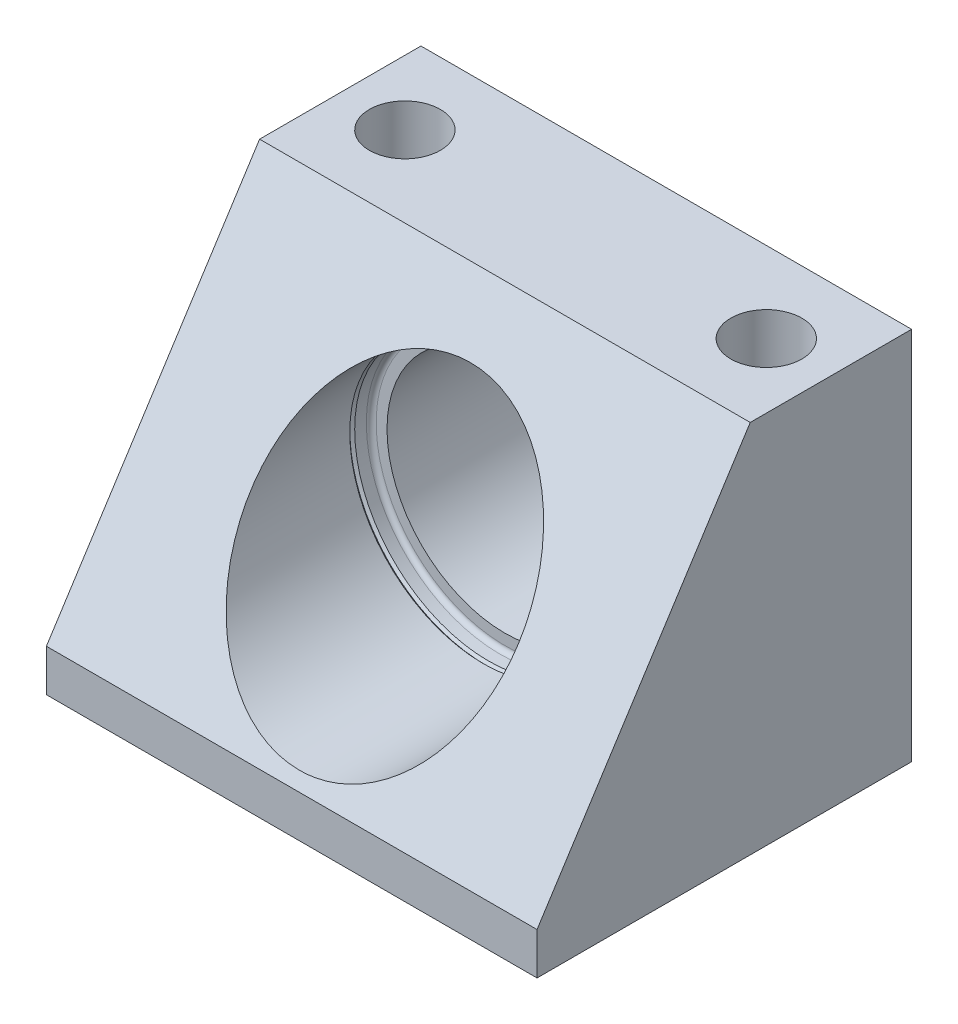
ISO-10303-21;
HEADER;
FILE_DESCRIPTION(('STEP AP214'),'2;1');
FILE_NAME('part.step','',(''),(''),'','','');
FILE_SCHEMA(('AUTOMOTIVE_DESIGN { 1 0 10303 214 1 1 1 1 }'));
ENDSEC;
DATA;
#1=APPLICATION_CONTEXT('core data for automotive mechanical design processes');
#2=APPLICATION_PROTOCOL_DEFINITION('international standard','automotive_design',2000,#1);
#3=PRODUCT_CONTEXT('',#1,'mechanical');
#4=PRODUCT('Part','Part','',(#3));
#5=PRODUCT_RELATED_PRODUCT_CATEGORY('part','',(#4));
#6=PRODUCT_DEFINITION_FORMATION('','',#4);
#7=PRODUCT_DEFINITION_CONTEXT('part definition',#1,'design');
#8=PRODUCT_DEFINITION('design','',#6,#7);
#9=PRODUCT_DEFINITION_SHAPE('','',#8);
#10=(LENGTH_UNIT() NAMED_UNIT(*) SI_UNIT(.MILLI.,.METRE.));
#11=(NAMED_UNIT(*) PLANE_ANGLE_UNIT() SI_UNIT($,.RADIAN.));
#12=(NAMED_UNIT(*) SI_UNIT($,.STERADIAN.) SOLID_ANGLE_UNIT());
#13=UNCERTAINTY_MEASURE_WITH_UNIT(LENGTH_MEASURE(1.E-05),#10,'distance_accuracy_value','');
#14=(GEOMETRIC_REPRESENTATION_CONTEXT(3) GLOBAL_UNCERTAINTY_ASSIGNED_CONTEXT((#13)) GLOBAL_UNIT_ASSIGNED_CONTEXT((#10,
#11,#12)) REPRESENTATION_CONTEXT('',''));
#15=CARTESIAN_POINT('',(0.,0.,0.));
#16=DIRECTION('',(0.,0.,1.));
#17=DIRECTION('',(1.,0.,0.));
#18=AXIS2_PLACEMENT_3D('',#15,#16,#17);
#19=CARTESIAN_POINT('',(37.9984,29.0068,-58.0136));
#20=DIRECTION('',(0.,0.,1.));
#21=DIRECTION('',(1.,0.,0.));
#22=AXIS2_PLACEMENT_3D('',#19,#20,#21);
#23=CYLINDRICAL_SURFACE('',#22,18.2625);
#24=CARTESIAN_POINT('',(37.9984,29.0068,-33.02));
#25=DIRECTION('',(0.,0.,1.));
#26=DIRECTION('',(1.,0.,0.));
#27=AXIS2_PLACEMENT_3D('',#24,#25,#26);
#28=CIRCLE('',#27,18.2625);
#29=CARTESIAN_POINT('',(56.2609,29.0068,-33.02));
#30=VERTEX_POINT('',#29);
#31=EDGE_CURVE('E119',#30,#30,#28,.F.);
#32=ORIENTED_EDGE('',*,*,#31,.F.);
#33=EDGE_LOOP('',(#32));
#34=FACE_BOUND('',#33,.T.);
#35=CARTESIAN_POINT('',(37.9984,29.0068,-56.8451));
#36=DIRECTION('',(0.,0.,1.));
#37=DIRECTION('',(1.,0.,0.));
#38=AXIS2_PLACEMENT_3D('',#35,#36,#37);
#39=CIRCLE('',#38,18.2625);
#40=CARTESIAN_POINT('',(56.2609,29.0068,-56.8451));
#41=VERTEX_POINT('',#40);
#42=EDGE_CURVE('E204',#41,#41,#39,.T.);
#43=ORIENTED_EDGE('',*,*,#42,.F.);
#44=EDGE_LOOP('',(#43));
#45=FACE_BOUND('',#44,.T.);
#46=ADVANCED_FACE('F35',(#34,#45),#23,.F.);
#47=CARTESIAN_POINT('',(0.,58.0136,-58.0136));
#48=DIRECTION('',(0.,0.,1.));
#49=DIRECTION('',(1.,0.,0.));
#50=AXIS2_PLACEMENT_3D('',#47,#48,#49);
#51=PLANE('',#50);
#52=DIRECTION('',(0.,-1.,0.));
#53=VECTOR('',#52,1.);
#54=CARTESIAN_POINT('',(0.,58.0136,-58.0136));
#55=LINE('',#54,#53);
#56=CARTESIAN_POINT('',(0.,58.0136,-58.0136));
#57=VERTEX_POINT('',#56);
#58=CARTESIAN_POINT('',(0.,0.,-58.0136));
#59=VERTEX_POINT('',#58);
#60=EDGE_CURVE('E128',#57,#59,#55,.T.);
#61=ORIENTED_EDGE('',*,*,#60,.F.);
#62=DIRECTION('',(-1.,0.,0.));
#63=VECTOR('',#62,1.);
#64=CARTESIAN_POINT('',(0.,58.0136,-58.0136));
#65=LINE('',#64,#63);
#66=CARTESIAN_POINT('',(75.9968,58.0136,-58.0136));
#67=VERTEX_POINT('',#66);
#68=EDGE_CURVE('E105',#67,#57,#65,.T.);
#69=ORIENTED_EDGE('',*,*,#68,.F.);
#70=DIRECTION('',(0.,1.,0.));
#71=VECTOR('',#70,1.);
#72=CARTESIAN_POINT('',(75.9968,58.0136,-58.0136));
#73=LINE('',#72,#71);
#74=CARTESIAN_POINT('',(75.9968,0.,-58.0136));
#75=VERTEX_POINT('',#74);
#76=EDGE_CURVE('E132',#75,#67,#73,.T.);
#77=ORIENTED_EDGE('',*,*,#76,.F.);
#78=DIRECTION('',(1.,0.,0.));
#79=VECTOR('',#78,1.);
#80=CARTESIAN_POINT('',(0.,0.,-58.0136));
#81=LINE('',#80,#79);
#82=EDGE_CURVE('E130',#59,#75,#81,.T.);
#83=ORIENTED_EDGE('',*,*,#82,.F.);
#84=EDGE_LOOP('',(#61,#69,#77,#83));
#85=FACE_BOUND('',#84,.T.);
#86=CARTESIAN_POINT('',(37.9984,29.0068,-58.0136));
#87=DIRECTION('',(0.,0.,1.));
#88=DIRECTION('',(1.,0.,0.));
#89=AXIS2_PLACEMENT_3D('',#86,#87,#88);
#90=CIRCLE('',#89,19.431);
#91=CARTESIAN_POINT('',(57.4294,29.0068,-58.0136));
#92=VERTEX_POINT('',#91);
#93=EDGE_CURVE('E201',#92,#92,#90,.T.);
#94=ORIENTED_EDGE('',*,*,#93,.T.);
#95=EDGE_LOOP('',(#94));
#96=FACE_BOUND('',#95,.T.);
#97=ADVANCED_FACE('F145',(#85,#96),#51,.F.);
#98=CARTESIAN_POINT('',(37.9984,29.0068,-116.564869909371));
#99=DIRECTION('',(0.,0.,1.));
#100=DIRECTION('',(1.,0.,0.));
#101=AXIS2_PLACEMENT_3D('',#98,#99,#100);
#102=CYLINDRICAL_SURFACE('',#101,20.701);
#103=CARTESIAN_POINT('',(37.9984,29.0068,-14.4258974358974));
#104=DIRECTION('',(0.,-0.539666114720432,-0.841879138963874));
#105=DIRECTION('',(0.,-0.841879138963874,0.539666114720432));
#106=AXIS2_PLACEMENT_3D('',#103,#104,#105);
#107=ELLIPSE('',#106,24.5890402100679,20.701);
#108=CARTESIAN_POINT('',(37.9984,8.30579999999999,-1.15602564102561));
#109=VERTEX_POINT('',#108);
#110=EDGE_CURVE('E116',#109,#109,#107,.F.);
#111=ORIENTED_EDGE('',*,*,#110,.T.);
#112=EDGE_LOOP('',(#111));
#113=FACE_BOUND('',#112,.T.);
#114=CARTESIAN_POINT('',(37.9984,29.0068,-29.6926));
#115=DIRECTION('',(0.,0.,1.));
#116=DIRECTION('',(1.,0.,0.));
#117=AXIS2_PLACEMENT_3D('',#114,#115,#116);
#118=CIRCLE('',#117,20.701);
#119=CARTESIAN_POINT('',(58.6994,29.0068,-29.6926));
#120=VERTEX_POINT('',#119);
#121=EDGE_CURVE('E198',#120,#120,#118,.T.);
#122=ORIENTED_EDGE('',*,*,#121,.F.);
#123=EDGE_LOOP('',(#122));
#124=FACE_BOUND('',#123,.T.);
#125=ADVANCED_FACE('F166',(#113,#124),#102,.F.);
#126=CARTESIAN_POINT('',(37.9984,29.0068,-32.258));
#127=DIRECTION('',(0.,0.,1.));
#128=DIRECTION('',(1.,0.,0.));
#129=AXIS2_PLACEMENT_3D('',#126,#127,#128);
#130=CIRCLE('',#129,20.701);
#131=CARTESIAN_POINT('',(58.6994,29.0068,-32.258));
#132=VERTEX_POINT('',#131);
#133=EDGE_CURVE('E12',#132,#132,#130,.F.);
#134=ORIENTED_EDGE('',*,*,#133,.T.);
#135=EDGE_LOOP('',(#134));
#136=FACE_BOUND('',#135,.T.);
#137=CARTESIAN_POINT('',(37.9984,29.0068,-30.4546));
#138=DIRECTION('',(0.,0.,1.));
#139=DIRECTION('',(1.,0.,0.));
#140=AXIS2_PLACEMENT_3D('',#137,#138,#139);
#141=CIRCLE('',#140,20.701);
#142=CARTESIAN_POINT('',(58.6994,29.0068,-30.4546));
#143=VERTEX_POINT('',#142);
#144=EDGE_CURVE('E195',#143,#143,#141,.T.);
#145=ORIENTED_EDGE('',*,*,#144,.T.);
#146=EDGE_LOOP('',(#145));
#147=FACE_BOUND('',#146,.T.);
#148=ADVANCED_FACE('F234',(#136,#147),#102,.F.);
#149=CARTESIAN_POINT('',(0.,58.0136,-33.02));
#150=DIRECTION('',(0.,-0.539666114720432,-0.841879138963874));
#151=DIRECTION('',(0.,0.841879138963874,-0.539666114720432));
#152=AXIS2_PLACEMENT_3D('',#149,#150,#151);
#153=PLANE('',#152);
#154=DIRECTION('',(0.,0.841879138963874,-0.539666114720432));
#155=VECTOR('',#154,1.);
#156=CARTESIAN_POINT('',(75.9968,58.0136,-33.02));
#157=LINE('',#156,#155);
#158=CARTESIAN_POINT('',(75.9968,6.50240000000002,0.));
#159=VERTEX_POINT('',#158);
#160=CARTESIAN_POINT('',(75.9968,58.0136,-33.02));
#161=VERTEX_POINT('',#160);
#162=EDGE_CURVE('E93',#159,#161,#157,.T.);
#163=ORIENTED_EDGE('',*,*,#162,.T.);
#164=DIRECTION('',(1.,0.,0.));
#165=VECTOR('',#164,1.);
#166=CARTESIAN_POINT('',(0.,58.0136,-33.02));
#167=LINE('',#166,#165);
#168=CARTESIAN_POINT('',(0.,58.0136,-33.02));
#169=VERTEX_POINT('',#168);
#170=EDGE_CURVE('E89',#169,#161,#167,.T.);
#171=ORIENTED_EDGE('',*,*,#170,.F.);
#172=DIRECTION('',(0.,0.841879138963874,-0.539666114720432));
#173=VECTOR('',#172,1.);
#174=CARTESIAN_POINT('',(0.,58.0136,-33.02));
#175=LINE('',#174,#173);
#176=CARTESIAN_POINT('',(0.,6.50240000000003,0.));
#177=VERTEX_POINT('',#176);
#178=EDGE_CURVE('E50',#177,#169,#175,.T.);
#179=ORIENTED_EDGE('',*,*,#178,.F.);
#180=DIRECTION('',(1.,0.,0.));
#181=VECTOR('',#180,1.);
#182=CARTESIAN_POINT('',(0.,6.50240000000003,0.));
#183=LINE('',#182,#181);
#184=EDGE_CURVE('E97',#177,#159,#183,.T.);
#185=ORIENTED_EDGE('',*,*,#184,.T.);
#186=EDGE_LOOP('',(#163,#171,#179,#185));
#187=FACE_BOUND('',#186,.T.);
#188=ORIENTED_EDGE('',*,*,#110,.F.);
#189=EDGE_LOOP('',(#188));
#190=FACE_BOUND('',#189,.T.);
#191=ADVANCED_FACE('F90',(#187,#190),#153,.F.);
#192=CARTESIAN_POINT('',(0.,58.0136,-58.0136));
#193=DIRECTION('',(-1.,0.,0.));
#194=DIRECTION('',(0.,-1.,0.));
#195=AXIS2_PLACEMENT_3D('',#192,#193,#194);
#196=PLANE('',#195);
#197=ORIENTED_EDGE('',*,*,#178,.T.);
#198=DIRECTION('',(0.,0.,1.));
#199=VECTOR('',#198,1.);
#200=CARTESIAN_POINT('',(0.,58.0136,-58.0136));
#201=LINE('',#200,#199);
#202=EDGE_CURVE('E58',#57,#169,#201,.T.);
#203=ORIENTED_EDGE('',*,*,#202,.F.);
#204=ORIENTED_EDGE('',*,*,#60,.T.);
#205=DIRECTION('',(0.,0.,1.));
#206=VECTOR('',#205,1.);
#207=CARTESIAN_POINT('',(0.,0.,-58.0136));
#208=LINE('',#207,#206);
#209=CARTESIAN_POINT('',(0.,0.,0.));
#210=VERTEX_POINT('',#209);
#211=EDGE_CURVE('E80',#59,#210,#208,.T.);
#212=ORIENTED_EDGE('',*,*,#211,.T.);
#213=DIRECTION('',(0.,-1.,0.));
#214=VECTOR('',#213,1.);
#215=CARTESIAN_POINT('',(0.,58.0136,0.));
#216=LINE('',#215,#214);
#217=EDGE_CURVE('E96',#177,#210,#216,.T.);
#218=ORIENTED_EDGE('',*,*,#217,.F.);
#219=EDGE_LOOP('',(#197,#203,#204,#212,#218));
#220=FACE_BOUND('',#219,.T.);
#221=ADVANCED_FACE('F100',(#220),#196,.T.);
#222=CARTESIAN_POINT('',(0.,58.0136,-58.0136));
#223=DIRECTION('',(0.,1.,0.));
#224=DIRECTION('',(0.,0.,1.));
#225=AXIS2_PLACEMENT_3D('',#222,#223,#224);
#226=PLANE('',#225);
#227=CARTESIAN_POINT('',(10.0076,58.0136,-45.5168));
#228=DIRECTION('',(0.,1.,0.));
#229=DIRECTION('',(0.,0.,1.));
#230=AXIS2_PLACEMENT_3D('',#227,#228,#229);
#231=CIRCLE('',#230,5.49910000000001);
#232=CARTESIAN_POINT('',(10.0076,58.0136,-40.0177));
#233=VERTEX_POINT('',#232);
#234=EDGE_CURVE('E180',#233,#233,#231,.T.);
#235=ORIENTED_EDGE('',*,*,#234,.F.);
#236=EDGE_LOOP('',(#235));
#237=FACE_BOUND('',#236,.T.);
#238=CARTESIAN_POINT('',(65.9892,58.0136,-45.5168));
#239=DIRECTION('',(0.,1.,0.));
#240=DIRECTION('',(0.,0.,1.));
#241=AXIS2_PLACEMENT_3D('',#238,#239,#240);
#242=CIRCLE('',#241,5.49910000000001);
#243=CARTESIAN_POINT('',(65.9892,58.0136,-40.0177));
#244=VERTEX_POINT('',#243);
#245=EDGE_CURVE('E183',#244,#244,#242,.T.);
#246=ORIENTED_EDGE('',*,*,#245,.F.);
#247=EDGE_LOOP('',(#246));
#248=FACE_BOUND('',#247,.T.);
#249=ORIENTED_EDGE('',*,*,#170,.T.);
#250=DIRECTION('',(0.,0.,1.));
#251=VECTOR('',#250,1.);
#252=CARTESIAN_POINT('',(75.9968,58.0136,-58.0136));
#253=LINE('',#252,#251);
#254=EDGE_CURVE('E106',#67,#161,#253,.T.);
#255=ORIENTED_EDGE('',*,*,#254,.F.);
#256=ORIENTED_EDGE('',*,*,#68,.T.);
#257=ORIENTED_EDGE('',*,*,#202,.T.);
#258=EDGE_LOOP('',(#249,#255,#256,#257));
#259=FACE_BOUND('',#258,.T.);
#260=ADVANCED_FACE('F103',(#237,#248,#259),#226,.T.);
#261=CARTESIAN_POINT('',(75.9968,58.0136,-58.0136));
#262=DIRECTION('',(1.,0.,0.));
#263=DIRECTION('',(0.,1.,0.));
#264=AXIS2_PLACEMENT_3D('',#261,#262,#263);
#265=PLANE('',#264);
#266=ORIENTED_EDGE('',*,*,#162,.F.);
#267=DIRECTION('',(0.,1.,0.));
#268=VECTOR('',#267,1.);
#269=CARTESIAN_POINT('',(75.9968,58.0136,0.));
#270=LINE('',#269,#268);
#271=CARTESIAN_POINT('',(75.9968,0.,0.));
#272=VERTEX_POINT('',#271);
#273=EDGE_CURVE('E111',#272,#159,#270,.T.);
#274=ORIENTED_EDGE('',*,*,#273,.F.);
#275=DIRECTION('',(0.,0.,1.));
#276=VECTOR('',#275,1.);
#277=CARTESIAN_POINT('',(75.9968,0.,-58.0136));
#278=LINE('',#277,#276);
#279=EDGE_CURVE('E75',#75,#272,#278,.T.);
#280=ORIENTED_EDGE('',*,*,#279,.F.);
#281=ORIENTED_EDGE('',*,*,#76,.T.);
#282=ORIENTED_EDGE('',*,*,#254,.T.);
#283=EDGE_LOOP('',(#266,#274,#280,#281,#282));
#284=FACE_BOUND('',#283,.T.);
#285=ADVANCED_FACE('F142',(#284),#265,.T.);
#286=CARTESIAN_POINT('',(0.,0.,-58.0136));
#287=DIRECTION('',(0.,-1.,0.));
#288=DIRECTION('',(0.,0.,-1.));
#289=AXIS2_PLACEMENT_3D('',#286,#287,#288);
#290=PLANE('',#289);
#291=CARTESIAN_POINT('',(10.0076,0.,-45.5168));
#292=DIRECTION('',(0.,-1.,0.));
#293=DIRECTION('',(0.,0.,-1.));
#294=AXIS2_PLACEMENT_3D('',#291,#292,#293);
#295=CIRCLE('',#294,5.49910000000001);
#296=CARTESIAN_POINT('',(10.0076,0.,-51.0159));
#297=VERTEX_POINT('',#296);
#298=EDGE_CURVE('E185',#297,#297,#295,.T.);
#299=ORIENTED_EDGE('',*,*,#298,.F.);
#300=EDGE_LOOP('',(#299));
#301=FACE_BOUND('',#300,.T.);
#302=CARTESIAN_POINT('',(65.9892,0.,-45.5168));
#303=DIRECTION('',(0.,-1.,0.));
#304=DIRECTION('',(0.,0.,-1.));
#305=AXIS2_PLACEMENT_3D('',#302,#303,#304);
#306=CIRCLE('',#305,5.49910000000001);
#307=CARTESIAN_POINT('',(65.9892,0.,-51.0159));
#308=VERTEX_POINT('',#307);
#309=EDGE_CURVE('E120',#308,#308,#306,.T.);
#310=ORIENTED_EDGE('',*,*,#309,.F.);
#311=EDGE_LOOP('',(#310));
#312=FACE_BOUND('',#311,.T.);
#313=DIRECTION('',(1.,0.,0.));
#314=VECTOR('',#313,1.);
#315=CARTESIAN_POINT('',(0.,0.,0.));
#316=LINE('',#315,#314);
#317=EDGE_CURVE('E136',#210,#272,#316,.T.);
#318=ORIENTED_EDGE('',*,*,#317,.F.);
#319=ORIENTED_EDGE('',*,*,#211,.F.);
#320=ORIENTED_EDGE('',*,*,#82,.T.);
#321=ORIENTED_EDGE('',*,*,#279,.T.);
#322=EDGE_LOOP('',(#318,#319,#320,#321));
#323=FACE_BOUND('',#322,.T.);
#324=ADVANCED_FACE('F147',(#301,#312,#323),#290,.T.);
#325=CARTESIAN_POINT('',(0.,58.0136,0.));
#326=DIRECTION('',(0.,0.,1.));
#327=DIRECTION('',(1.,0.,0.));
#328=AXIS2_PLACEMENT_3D('',#325,#326,#327);
#329=PLANE('',#328);
#330=ORIENTED_EDGE('',*,*,#184,.F.);
#331=ORIENTED_EDGE('',*,*,#217,.T.);
#332=ORIENTED_EDGE('',*,*,#317,.T.);
#333=ORIENTED_EDGE('',*,*,#273,.T.);
#334=EDGE_LOOP('',(#330,#331,#332,#333));
#335=FACE_BOUND('',#334,.T.);
#336=ADVANCED_FACE('F140',(#335),#329,.T.);
#337=CARTESIAN_POINT('',(0.,58.0136,-33.02));
#338=DIRECTION('',(0.,0.,1.));
#339=DIRECTION('',(1.,0.,0.));
#340=AXIS2_PLACEMENT_3D('',#337,#338,#339);
#341=PLANE('',#340);
#342=CARTESIAN_POINT('',(37.9984,29.0068,-33.02));
#343=DIRECTION('',(0.,0.,1.));
#344=DIRECTION('',(1.,0.,0.));
#345=AXIS2_PLACEMENT_3D('',#342,#343,#344);
#346=CIRCLE('',#345,19.939);
#347=CARTESIAN_POINT('',(57.9374,29.0068,-33.02));
#348=VERTEX_POINT('',#347);
#349=EDGE_CURVE('E43',#348,#348,#346,.T.);
#350=ORIENTED_EDGE('',*,*,#349,.T.);
#351=EDGE_LOOP('',(#350));
#352=FACE_BOUND('',#351,.T.);
#353=ORIENTED_EDGE('',*,*,#31,.T.);
#354=EDGE_LOOP('',(#353));
#355=FACE_BOUND('',#354,.T.);
#356=ADVANCED_FACE('F155',(#352,#355),#341,.T.);
#357=CARTESIAN_POINT('',(37.9984,29.0068,-32.258));
#358=DIRECTION('',(0.,0.,1.));
#359=DIRECTION('',(1.,0.,0.));
#360=AXIS2_PLACEMENT_3D('',#357,#358,#359);
#361=TOROIDAL_SURFACE('',#360,19.939,0.762);
#362=ORIENTED_EDGE('',*,*,#133,.F.);
#363=EDGE_LOOP('',(#362));
#364=FACE_BOUND('',#363,.T.);
#365=ORIENTED_EDGE('',*,*,#349,.F.);
#366=EDGE_LOOP('',(#365));
#367=FACE_BOUND('',#366,.T.);
#368=ADVANCED_FACE('F37',(#364,#367),#361,.F.);
#369=CARTESIAN_POINT('',(65.9892,58.0136,-45.5168));
#370=DIRECTION('',(0.,1.,0.));
#371=DIRECTION('',(0.,0.,1.));
#372=AXIS2_PLACEMENT_3D('',#369,#370,#371);
#373=CYLINDRICAL_SURFACE('',#372,5.49910000000001);
#374=ORIENTED_EDGE('',*,*,#245,.T.);
#375=EDGE_LOOP('',(#374));
#376=FACE_BOUND('',#375,.T.);
#377=ORIENTED_EDGE('',*,*,#309,.T.);
#378=EDGE_LOOP('',(#377));
#379=FACE_BOUND('',#378,.T.);
#380=ADVANCED_FACE('F227',(#376,#379),#373,.F.);
#381=CARTESIAN_POINT('',(10.0076,58.0136,-45.5168));
#382=DIRECTION('',(0.,1.,0.));
#383=DIRECTION('',(0.,0.,1.));
#384=AXIS2_PLACEMENT_3D('',#381,#382,#383);
#385=CYLINDRICAL_SURFACE('',#384,5.49910000000001);
#386=ORIENTED_EDGE('',*,*,#234,.T.);
#387=EDGE_LOOP('',(#386));
#388=FACE_BOUND('',#387,.T.);
#389=ORIENTED_EDGE('',*,*,#298,.T.);
#390=EDGE_LOOP('',(#389));
#391=FACE_BOUND('',#390,.T.);
#392=ADVANCED_FACE('F223',(#388,#391),#385,.F.);
#393=CARTESIAN_POINT('',(37.9984,29.0068,-30.0736));
#394=DIRECTION('',(0.,0.,-1.));
#395=DIRECTION('',(-1.,0.,0.));
#396=AXIS2_PLACEMENT_3D('',#393,#394,#395);
#397=CONICAL_SURFACE('',#396,21.082,0.785398163397466);
#398=ORIENTED_EDGE('',*,*,#121,.T.);
#399=EDGE_LOOP('',(#398));
#400=FACE_BOUND('',#399,.T.);
#401=CARTESIAN_POINT('',(37.9984,29.0068,-30.0736));
#402=DIRECTION('',(0.,0.,1.));
#403=DIRECTION('',(1.,0.,0.));
#404=AXIS2_PLACEMENT_3D('',#401,#402,#403);
#405=CIRCLE('',#404,21.082);
#406=CARTESIAN_POINT('',(59.0804,29.0068,-30.0736));
#407=VERTEX_POINT('',#406);
#408=EDGE_CURVE('E192',#407,#407,#405,.T.);
#409=ORIENTED_EDGE('',*,*,#408,.F.);
#410=EDGE_LOOP('',(#409));
#411=FACE_BOUND('',#410,.T.);
#412=ADVANCED_FACE('F217',(#400,#411),#397,.F.);
#413=CARTESIAN_POINT('',(37.9984,29.0068,-30.4546));
#414=DIRECTION('',(0.,0.,1.));
#415=DIRECTION('',(1.,0.,0.));
#416=AXIS2_PLACEMENT_3D('',#413,#414,#415);
#417=CONICAL_SURFACE('',#416,20.701,0.78539816339743);
#418=ORIENTED_EDGE('',*,*,#408,.T.);
#419=EDGE_LOOP('',(#418));
#420=FACE_BOUND('',#419,.T.);
#421=ORIENTED_EDGE('',*,*,#144,.F.);
#422=EDGE_LOOP('',(#421));
#423=FACE_BOUND('',#422,.T.);
#424=ADVANCED_FACE('F211',(#420,#423),#417,.F.);
#425=CARTESIAN_POINT('',(37.9984,29.0068,-58.0136));
#426=DIRECTION('',(0.,0.,-1.));
#427=DIRECTION('',(-1.,0.,0.));
#428=AXIS2_PLACEMENT_3D('',#425,#426,#427);
#429=CONICAL_SURFACE('',#428,19.431,0.785398163397441);
#430=ORIENTED_EDGE('',*,*,#42,.T.);
#431=EDGE_LOOP('',(#430));
#432=FACE_BOUND('',#431,.T.);
#433=ORIENTED_EDGE('',*,*,#93,.F.);
#434=EDGE_LOOP('',(#433));
#435=FACE_BOUND('',#434,.T.);
#436=ADVANCED_FACE('F208',(#432,#435),#429,.F.);
#437=CLOSED_SHELL('',(#46,#97,#125,#148,#191,#221,#260,#285,#324,#336,#356,#368,#380,#392,#412,
#424,#436));
#438=MANIFOLD_SOLID_BREP('B2',#437);
#439=ADVANCED_BREP_SHAPE_REPRESENTATION('',(#18,#438),#14);
#440=SHAPE_DEFINITION_REPRESENTATION(#9,#439);
ENDSEC;
END-ISO-10303-21;
